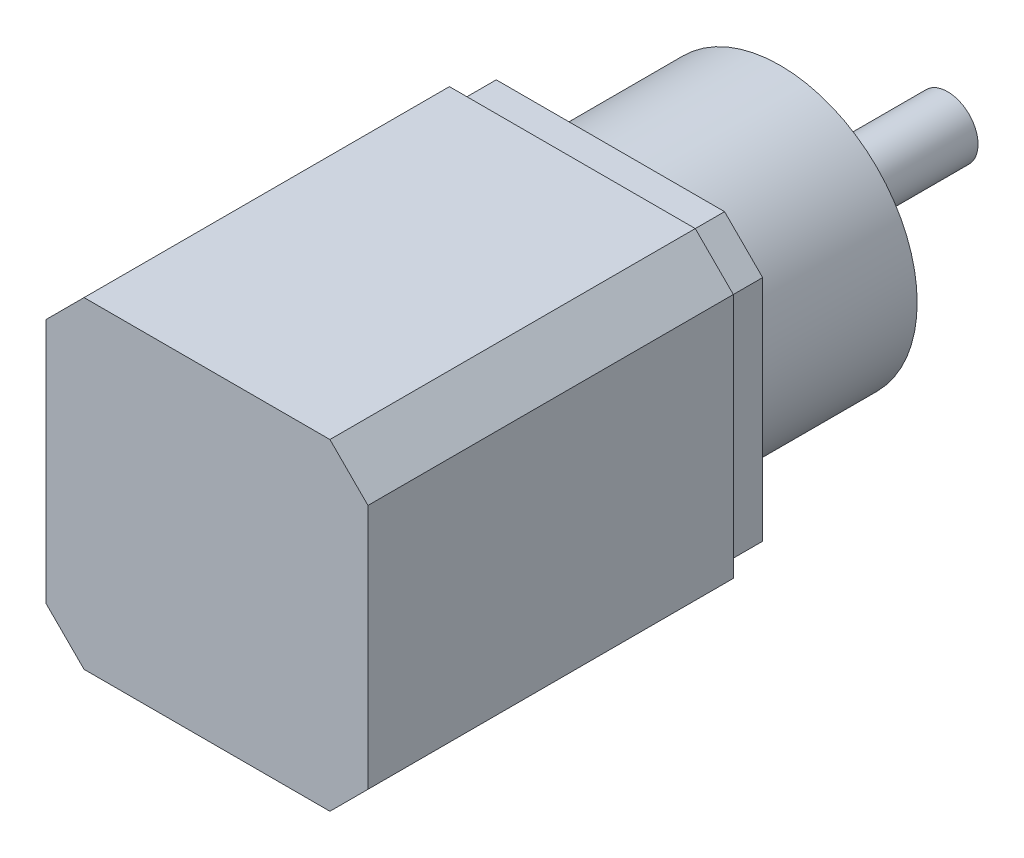
ISO-10303-21;
HEADER;
FILE_DESCRIPTION(('STEP AP214'),'2;1');
FILE_NAME('part.step','',(''),(''),'','','');
FILE_SCHEMA(('AUTOMOTIVE_DESIGN { 1 0 10303 214 1 1 1 1 }'));
ENDSEC;
DATA;
#1=APPLICATION_CONTEXT('core data for automotive mechanical design processes');
#2=APPLICATION_PROTOCOL_DEFINITION('international standard','automotive_design',2000,#1);
#3=PRODUCT_CONTEXT('',#1,'mechanical');
#4=PRODUCT('Part','Part','',(#3));
#5=PRODUCT_RELATED_PRODUCT_CATEGORY('part','',(#4));
#6=PRODUCT_DEFINITION_FORMATION('','',#4);
#7=PRODUCT_DEFINITION_CONTEXT('part definition',#1,'design');
#8=PRODUCT_DEFINITION('design','',#6,#7);
#9=PRODUCT_DEFINITION_SHAPE('','',#8);
#10=(LENGTH_UNIT() NAMED_UNIT(*) SI_UNIT(.MILLI.,.METRE.));
#11=(NAMED_UNIT(*) PLANE_ANGLE_UNIT() SI_UNIT($,.RADIAN.));
#12=(NAMED_UNIT(*) SI_UNIT($,.STERADIAN.) SOLID_ANGLE_UNIT());
#13=UNCERTAINTY_MEASURE_WITH_UNIT(LENGTH_MEASURE(1.E-05),#10,'distance_accuracy_value','');
#14=(GEOMETRIC_REPRESENTATION_CONTEXT(3) GLOBAL_UNCERTAINTY_ASSIGNED_CONTEXT((#13)) GLOBAL_UNIT_ASSIGNED_CONTEXT((#10,
#11,#12)) REPRESENTATION_CONTEXT('',''));
#15=CARTESIAN_POINT('',(0.,0.,0.));
#16=DIRECTION('',(0.,0.,1.));
#17=DIRECTION('',(1.,0.,0.));
#18=AXIS2_PLACEMENT_3D('',#15,#16,#17);
#19=CARTESIAN_POINT('',(0.,0.,0.));
#20=DIRECTION('',(0.,0.,1.));
#21=DIRECTION('',(1.,0.,0.));
#22=AXIS2_PLACEMENT_3D('',#19,#20,#21);
#23=PLANE('',#22);
#24=DIRECTION('',(-0.707106781186549,-0.707106781186546,0.));
#25=VECTOR('',#24,1.);
#26=CARTESIAN_POINT('',(-21.15,16.15,0.));
#27=LINE('',#26,#25);
#28=CARTESIAN_POINT('',(-21.15,16.15,0.));
#29=VERTEX_POINT('',#28);
#30=CARTESIAN_POINT('',(-16.15,21.15,0.));
#31=VERTEX_POINT('',#30);
#32=EDGE_CURVE('E244',#29,#31,#27,.F.);
#33=ORIENTED_EDGE('',*,*,#32,.T.);
#34=DIRECTION('',(-1.,0.,0.));
#35=VECTOR('',#34,1.);
#36=CARTESIAN_POINT('',(-21.15,21.15,0.));
#37=LINE('',#36,#35);
#38=CARTESIAN_POINT('',(16.15,21.15,0.));
#39=VERTEX_POINT('',#38);
#40=EDGE_CURVE('E228',#39,#31,#37,.T.);
#41=ORIENTED_EDGE('',*,*,#40,.F.);
#42=DIRECTION('',(-0.707106781186546,0.707106781186549,0.));
#43=VECTOR('',#42,1.);
#44=CARTESIAN_POINT('',(16.15,21.15,0.));
#45=LINE('',#44,#43);
#46=CARTESIAN_POINT('',(21.15,16.15,0.));
#47=VERTEX_POINT('',#46);
#48=EDGE_CURVE('E241',#39,#47,#45,.F.);
#49=ORIENTED_EDGE('',*,*,#48,.T.);
#50=DIRECTION('',(0.,1.,0.));
#51=VECTOR('',#50,1.);
#52=CARTESIAN_POINT('',(21.15,21.15,0.));
#53=LINE('',#52,#51);
#54=CARTESIAN_POINT('',(21.15,-16.15,0.));
#55=VERTEX_POINT('',#54);
#56=EDGE_CURVE('E201',#55,#47,#53,.T.);
#57=ORIENTED_EDGE('',*,*,#56,.F.);
#58=DIRECTION('',(0.707106781186549,0.707106781186547,0.));
#59=VECTOR('',#58,1.);
#60=CARTESIAN_POINT('',(21.15,-16.15,0.));
#61=LINE('',#60,#59);
#62=CARTESIAN_POINT('',(16.15,-21.15,0.));
#63=VERTEX_POINT('',#62);
#64=EDGE_CURVE('E247',#55,#63,#61,.F.);
#65=ORIENTED_EDGE('',*,*,#64,.T.);
#66=DIRECTION('',(1.,0.,0.));
#67=VECTOR('',#66,1.);
#68=CARTESIAN_POINT('',(-21.15,-21.15,0.));
#69=LINE('',#68,#67);
#70=CARTESIAN_POINT('',(-16.15,-21.15,0.));
#71=VERTEX_POINT('',#70);
#72=EDGE_CURVE('E216',#71,#63,#69,.T.);
#73=ORIENTED_EDGE('',*,*,#72,.F.);
#74=DIRECTION('',(0.707106781186546,-0.707106781186549,0.));
#75=VECTOR('',#74,1.);
#76=CARTESIAN_POINT('',(-16.15,-21.15,0.));
#77=LINE('',#76,#75);
#78=CARTESIAN_POINT('',(-21.15,-16.15,0.));
#79=VERTEX_POINT('',#78);
#80=EDGE_CURVE('E250',#71,#79,#77,.F.);
#81=ORIENTED_EDGE('',*,*,#80,.T.);
#82=DIRECTION('',(0.,-1.,0.));
#83=VECTOR('',#82,1.);
#84=CARTESIAN_POINT('',(-21.15,21.15,0.));
#85=LINE('',#84,#83);
#86=EDGE_CURVE('E231',#29,#79,#85,.T.);
#87=ORIENTED_EDGE('',*,*,#86,.F.);
#88=EDGE_LOOP('',(#33,#41,#49,#57,#65,#73,#81,#87));
#89=FACE_BOUND('',#88,.T.);
#90=DIRECTION('',(0.,1.,0.));
#91=VECTOR('',#90,1.);
#92=CARTESIAN_POINT('',(-20.,-20.,0.));
#93=LINE('',#92,#91);
#94=CARTESIAN_POINT('',(-20.,-15.,0.));
#95=VERTEX_POINT('',#94);
#96=CARTESIAN_POINT('',(-20.,15.,0.));
#97=VERTEX_POINT('',#96);
#98=EDGE_CURVE('E202',#95,#97,#93,.T.);
#99=ORIENTED_EDGE('',*,*,#98,.F.);
#100=DIRECTION('',(-0.707106781186549,0.707106781186547,0.));
#101=VECTOR('',#100,1.);
#102=CARTESIAN_POINT('',(-17.5,-17.5,0.));
#103=LINE('',#102,#101);
#104=CARTESIAN_POINT('',(-15.,-20.,0.));
#105=VERTEX_POINT('',#104);
#106=EDGE_CURVE('E150',#95,#105,#103,.F.);
#107=ORIENTED_EDGE('',*,*,#106,.T.);
#108=DIRECTION('',(-1.,0.,0.));
#109=VECTOR('',#108,1.);
#110=CARTESIAN_POINT('',(20.,-20.,0.));
#111=LINE('',#110,#109);
#112=CARTESIAN_POINT('',(15.,-20.,0.));
#113=VERTEX_POINT('',#112);
#114=EDGE_CURVE('E205',#113,#105,#111,.T.);
#115=ORIENTED_EDGE('',*,*,#114,.F.);
#116=DIRECTION('',(-0.707106781186547,-0.707106781186549,0.));
#117=VECTOR('',#116,1.);
#118=CARTESIAN_POINT('',(17.5,-17.5,0.));
#119=LINE('',#118,#117);
#120=CARTESIAN_POINT('',(20.,-15.,0.));
#121=VERTEX_POINT('',#120);
#122=EDGE_CURVE('E118',#113,#121,#119,.F.);
#123=ORIENTED_EDGE('',*,*,#122,.T.);
#124=DIRECTION('',(0.,-1.,0.));
#125=VECTOR('',#124,1.);
#126=CARTESIAN_POINT('',(20.,-20.,0.));
#127=LINE('',#126,#125);
#128=CARTESIAN_POINT('',(20.,15.,0.));
#129=VERTEX_POINT('',#128);
#130=EDGE_CURVE('E207',#129,#121,#127,.T.);
#131=ORIENTED_EDGE('',*,*,#130,.F.);
#132=DIRECTION('',(0.707106781186549,-0.707106781186547,0.));
#133=VECTOR('',#132,1.);
#134=CARTESIAN_POINT('',(17.5,17.5,0.));
#135=LINE('',#134,#133);
#136=CARTESIAN_POINT('',(15.,20.,0.));
#137=VERTEX_POINT('',#136);
#138=EDGE_CURVE('E55',#129,#137,#135,.F.);
#139=ORIENTED_EDGE('',*,*,#138,.T.);
#140=DIRECTION('',(1.,0.,0.));
#141=VECTOR('',#140,1.);
#142=CARTESIAN_POINT('',(20.,20.,0.));
#143=LINE('',#142,#141);
#144=CARTESIAN_POINT('',(-15.,20.,0.));
#145=VERTEX_POINT('',#144);
#146=EDGE_CURVE('E116',#145,#137,#143,.T.);
#147=ORIENTED_EDGE('',*,*,#146,.F.);
#148=DIRECTION('',(0.707106781186547,0.707106781186549,0.));
#149=VECTOR('',#148,1.);
#150=CARTESIAN_POINT('',(-17.5,17.5,0.));
#151=LINE('',#150,#149);
#152=EDGE_CURVE('E154',#145,#97,#151,.F.);
#153=ORIENTED_EDGE('',*,*,#152,.T.);
#154=EDGE_LOOP('',(#99,#107,#115,#123,#131,#139,#147,#153));
#155=FACE_BOUND('',#154,.T.);
#156=ADVANCED_FACE('F32',(#89,#155),#23,.F.);
#157=CARTESIAN_POINT('',(21.15,21.15,48.));
#158=DIRECTION('',(-1.,0.,0.));
#159=DIRECTION('',(0.,-1.,0.));
#160=AXIS2_PLACEMENT_3D('',#157,#158,#159);
#161=PLANE('',#160);
#162=DIRECTION('',(0.,1.,0.));
#163=VECTOR('',#162,1.);
#164=CARTESIAN_POINT('',(21.15,21.15,48.));
#165=LINE('',#164,#163);
#166=CARTESIAN_POINT('',(21.15,-16.15,48.));
#167=VERTEX_POINT('',#166);
#168=CARTESIAN_POINT('',(21.15,16.15,48.));
#169=VERTEX_POINT('',#168);
#170=EDGE_CURVE('E212',#167,#169,#165,.T.);
#171=ORIENTED_EDGE('',*,*,#170,.F.);
#172=DIRECTION('',(0.,0.,-1.));
#173=VECTOR('',#172,1.);
#174=CARTESIAN_POINT('',(21.15,-16.15,48.));
#175=LINE('',#174,#173);
#176=EDGE_CURVE('E274',#167,#55,#175,.T.);
#177=ORIENTED_EDGE('',*,*,#176,.T.);
#178=ORIENTED_EDGE('',*,*,#56,.T.);
#179=DIRECTION('',(0.,0.,1.));
#180=VECTOR('',#179,1.);
#181=CARTESIAN_POINT('',(21.15,16.15,48.));
#182=LINE('',#181,#180);
#183=EDGE_CURVE('E271',#47,#169,#182,.T.);
#184=ORIENTED_EDGE('',*,*,#183,.T.);
#185=EDGE_LOOP('',(#171,#177,#178,#184));
#186=FACE_BOUND('',#185,.T.);
#187=ADVANCED_FACE('F315',(#186),#161,.F.);
#188=CARTESIAN_POINT('',(-21.15,21.15,48.));
#189=DIRECTION('',(0.,-1.,0.));
#190=DIRECTION('',(0.,0.,-1.));
#191=AXIS2_PLACEMENT_3D('',#188,#189,#190);
#192=PLANE('',#191);
#193=ORIENTED_EDGE('',*,*,#40,.T.);
#194=DIRECTION('',(0.,0.,1.));
#195=VECTOR('',#194,1.);
#196=CARTESIAN_POINT('',(-16.15,21.15,48.));
#197=LINE('',#196,#195);
#198=CARTESIAN_POINT('',(-16.15,21.15,48.));
#199=VERTEX_POINT('',#198);
#200=EDGE_CURVE('E208',#31,#199,#197,.T.);
#201=ORIENTED_EDGE('',*,*,#200,.T.);
#202=DIRECTION('',(-1.,0.,0.));
#203=VECTOR('',#202,1.);
#204=CARTESIAN_POINT('',(-21.15,21.15,48.));
#205=LINE('',#204,#203);
#206=CARTESIAN_POINT('',(16.15,21.15,48.));
#207=VERTEX_POINT('',#206);
#208=EDGE_CURVE('E215',#207,#199,#205,.T.);
#209=ORIENTED_EDGE('',*,*,#208,.F.);
#210=DIRECTION('',(0.,0.,-1.));
#211=VECTOR('',#210,1.);
#212=CARTESIAN_POINT('',(16.15,21.15,48.));
#213=LINE('',#212,#211);
#214=EDGE_CURVE('E277',#207,#39,#213,.T.);
#215=ORIENTED_EDGE('',*,*,#214,.T.);
#216=EDGE_LOOP('',(#193,#201,#209,#215));
#217=FACE_BOUND('',#216,.T.);
#218=ADVANCED_FACE('F321',(#217),#192,.F.);
#219=CARTESIAN_POINT('',(-21.15,21.15,48.));
#220=DIRECTION('',(1.,0.,0.));
#221=DIRECTION('',(0.,1.,0.));
#222=AXIS2_PLACEMENT_3D('',#219,#220,#221);
#223=PLANE('',#222);
#224=ORIENTED_EDGE('',*,*,#86,.T.);
#225=DIRECTION('',(0.,0.,1.));
#226=VECTOR('',#225,1.);
#227=CARTESIAN_POINT('',(-21.15,-16.15,48.));
#228=LINE('',#227,#226);
#229=CARTESIAN_POINT('',(-21.15,-16.15,48.));
#230=VERTEX_POINT('',#229);
#231=EDGE_CURVE('E256',#79,#230,#228,.T.);
#232=ORIENTED_EDGE('',*,*,#231,.T.);
#233=DIRECTION('',(0.,-1.,0.));
#234=VECTOR('',#233,1.);
#235=CARTESIAN_POINT('',(-21.15,21.15,48.));
#236=LINE('',#235,#234);
#237=CARTESIAN_POINT('',(-21.15,16.15,48.));
#238=VERTEX_POINT('',#237);
#239=EDGE_CURVE('E219',#238,#230,#236,.T.);
#240=ORIENTED_EDGE('',*,*,#239,.F.);
#241=DIRECTION('',(0.,0.,-1.));
#242=VECTOR('',#241,1.);
#243=CARTESIAN_POINT('',(-21.15,16.15,48.));
#244=LINE('',#243,#242);
#245=EDGE_CURVE('E253',#238,#29,#244,.T.);
#246=ORIENTED_EDGE('',*,*,#245,.T.);
#247=EDGE_LOOP('',(#224,#232,#240,#246));
#248=FACE_BOUND('',#247,.T.);
#249=ADVANCED_FACE('F331',(#248),#223,.F.);
#250=CARTESIAN_POINT('',(-21.15,-21.15,48.));
#251=DIRECTION('',(0.,1.,0.));
#252=DIRECTION('',(0.,0.,1.));
#253=AXIS2_PLACEMENT_3D('',#250,#251,#252);
#254=PLANE('',#253);
#255=DIRECTION('',(1.,0.,0.));
#256=VECTOR('',#255,1.);
#257=CARTESIAN_POINT('',(-21.15,-21.15,48.));
#258=LINE('',#257,#256);
#259=CARTESIAN_POINT('',(-16.15,-21.15,48.));
#260=VERTEX_POINT('',#259);
#261=CARTESIAN_POINT('',(16.15,-21.15,48.));
#262=VERTEX_POINT('',#261);
#263=EDGE_CURVE('E222',#260,#262,#258,.T.);
#264=ORIENTED_EDGE('',*,*,#263,.F.);
#265=DIRECTION('',(0.,0.,-1.));
#266=VECTOR('',#265,1.);
#267=CARTESIAN_POINT('',(-16.15,-21.15,48.));
#268=LINE('',#267,#266);
#269=EDGE_CURVE('E238',#260,#71,#268,.T.);
#270=ORIENTED_EDGE('',*,*,#269,.T.);
#271=ORIENTED_EDGE('',*,*,#72,.T.);
#272=DIRECTION('',(0.,0.,1.));
#273=VECTOR('',#272,1.);
#274=CARTESIAN_POINT('',(16.15,-21.15,48.));
#275=LINE('',#274,#273);
#276=EDGE_CURVE('E225',#63,#262,#275,.T.);
#277=ORIENTED_EDGE('',*,*,#276,.T.);
#278=EDGE_LOOP('',(#264,#270,#271,#277));
#279=FACE_BOUND('',#278,.T.);
#280=ADVANCED_FACE('F328',(#279),#254,.F.);
#281=CARTESIAN_POINT('',(0.,0.,48.));
#282=DIRECTION('',(0.,0.,1.));
#283=DIRECTION('',(1.,0.,0.));
#284=AXIS2_PLACEMENT_3D('',#281,#282,#283);
#285=PLANE('',#284);
#286=ORIENTED_EDGE('',*,*,#239,.T.);
#287=DIRECTION('',(-0.707106781186546,0.707106781186549,0.));
#288=VECTOR('',#287,1.);
#289=CARTESIAN_POINT('',(-18.65,-18.65,48.));
#290=LINE('',#289,#288);
#291=EDGE_CURVE('E268',#230,#260,#290,.F.);
#292=ORIENTED_EDGE('',*,*,#291,.T.);
#293=ORIENTED_EDGE('',*,*,#263,.T.);
#294=DIRECTION('',(-0.707106781186549,-0.707106781186547,0.));
#295=VECTOR('',#294,1.);
#296=CARTESIAN_POINT('',(18.65,-18.65,48.));
#297=LINE('',#296,#295);
#298=EDGE_CURVE('E265',#262,#167,#297,.F.);
#299=ORIENTED_EDGE('',*,*,#298,.T.);
#300=ORIENTED_EDGE('',*,*,#170,.T.);
#301=DIRECTION('',(0.707106781186546,-0.707106781186549,0.));
#302=VECTOR('',#301,1.);
#303=CARTESIAN_POINT('',(18.65,18.65,48.));
#304=LINE('',#303,#302);
#305=EDGE_CURVE('E259',#169,#207,#304,.F.);
#306=ORIENTED_EDGE('',*,*,#305,.T.);
#307=ORIENTED_EDGE('',*,*,#208,.T.);
#308=DIRECTION('',(0.707106781186549,0.707106781186546,0.));
#309=VECTOR('',#308,1.);
#310=CARTESIAN_POINT('',(-18.65,18.65,48.));
#311=LINE('',#310,#309);
#312=EDGE_CURVE('E262',#199,#238,#311,.F.);
#313=ORIENTED_EDGE('',*,*,#312,.T.);
#314=EDGE_LOOP('',(#286,#292,#293,#299,#300,#306,#307,#313));
#315=FACE_BOUND('',#314,.T.);
#316=ADVANCED_FACE('F326',(#315),#285,.T.);
#317=CARTESIAN_POINT('',(-16.15,-21.15,48.));
#318=DIRECTION('',(0.707106781186549,0.707106781186546,0.));
#319=DIRECTION('',(0.,0.,-1.));
#320=AXIS2_PLACEMENT_3D('',#317,#318,#319);
#321=PLANE('',#320);
#322=ORIENTED_EDGE('',*,*,#291,.F.);
#323=ORIENTED_EDGE('',*,*,#231,.F.);
#324=ORIENTED_EDGE('',*,*,#80,.F.);
#325=ORIENTED_EDGE('',*,*,#269,.F.);
#326=EDGE_LOOP('',(#322,#323,#324,#325));
#327=FACE_BOUND('',#326,.T.);
#328=ADVANCED_FACE('F339',(#327),#321,.F.);
#329=CARTESIAN_POINT('',(21.15,-16.15,48.));
#330=DIRECTION('',(-0.707106781186546,0.707106781186548,0.));
#331=DIRECTION('',(0.,0.,-1.));
#332=AXIS2_PLACEMENT_3D('',#329,#330,#331);
#333=PLANE('',#332);
#334=ORIENTED_EDGE('',*,*,#298,.F.);
#335=ORIENTED_EDGE('',*,*,#276,.F.);
#336=ORIENTED_EDGE('',*,*,#64,.F.);
#337=ORIENTED_EDGE('',*,*,#176,.F.);
#338=EDGE_LOOP('',(#334,#335,#336,#337));
#339=FACE_BOUND('',#338,.T.);
#340=ADVANCED_FACE('F342',(#339),#333,.F.);
#341=CARTESIAN_POINT('',(-21.15,16.15,48.));
#342=DIRECTION('',(0.707106781186546,-0.707106781186549,0.));
#343=DIRECTION('',(0.,0.,-1.));
#344=AXIS2_PLACEMENT_3D('',#341,#342,#343);
#345=PLANE('',#344);
#346=ORIENTED_EDGE('',*,*,#312,.F.);
#347=ORIENTED_EDGE('',*,*,#200,.F.);
#348=ORIENTED_EDGE('',*,*,#32,.F.);
#349=ORIENTED_EDGE('',*,*,#245,.F.);
#350=EDGE_LOOP('',(#346,#347,#348,#349));
#351=FACE_BOUND('',#350,.T.);
#352=ADVANCED_FACE('F346',(#351),#345,.F.);
#353=CARTESIAN_POINT('',(16.15,21.15,48.));
#354=DIRECTION('',(-0.707106781186549,-0.707106781186546,0.));
#355=DIRECTION('',(0.,0.,-1.));
#356=AXIS2_PLACEMENT_3D('',#353,#354,#355);
#357=PLANE('',#356);
#358=ORIENTED_EDGE('',*,*,#305,.F.);
#359=ORIENTED_EDGE('',*,*,#183,.F.);
#360=ORIENTED_EDGE('',*,*,#48,.F.);
#361=ORIENTED_EDGE('',*,*,#214,.F.);
#362=EDGE_LOOP('',(#358,#359,#360,#361));
#363=FACE_BOUND('',#362,.T.);
#364=ADVANCED_FACE('F350',(#363),#357,.F.);
#365=CARTESIAN_POINT('',(-20.,-20.,-5.));
#366=DIRECTION('',(1.,0.,0.));
#367=DIRECTION('',(0.,0.,-1.));
#368=AXIS2_PLACEMENT_3D('',#365,#366,#367);
#369=PLANE('',#368);
#370=DIRECTION('',(0.,1.,0.));
#371=VECTOR('',#370,1.);
#372=CARTESIAN_POINT('',(-20.,-20.,-5.));
#373=LINE('',#372,#371);
#374=CARTESIAN_POINT('',(-20.,-15.,-5.));
#375=VERTEX_POINT('',#374);
#376=CARTESIAN_POINT('',(-20.,15.,-5.));
#377=VERTEX_POINT('',#376);
#378=EDGE_CURVE('E130',#375,#377,#373,.T.);
#379=ORIENTED_EDGE('',*,*,#378,.F.);
#380=DIRECTION('',(0.,0.,1.));
#381=VECTOR('',#380,1.);
#382=CARTESIAN_POINT('',(-20.,-15.,-5.));
#383=LINE('',#382,#381);
#384=EDGE_CURVE('E145',#375,#95,#383,.T.);
#385=ORIENTED_EDGE('',*,*,#384,.T.);
#386=ORIENTED_EDGE('',*,*,#98,.T.);
#387=DIRECTION('',(0.,0.,-1.));
#388=VECTOR('',#387,1.);
#389=CARTESIAN_POINT('',(-20.,15.,-5.));
#390=LINE('',#389,#388);
#391=EDGE_CURVE('E143',#97,#377,#390,.T.);
#392=ORIENTED_EDGE('',*,*,#391,.T.);
#393=EDGE_LOOP('',(#379,#385,#386,#392));
#394=FACE_BOUND('',#393,.T.);
#395=ADVANCED_FACE('F302',(#394),#369,.F.);
#396=CARTESIAN_POINT('',(20.,20.,-5.));
#397=DIRECTION('',(0.,-1.,0.));
#398=DIRECTION('',(0.,0.,-1.));
#399=AXIS2_PLACEMENT_3D('',#396,#397,#398);
#400=PLANE('',#399);
#401=ORIENTED_EDGE('',*,*,#146,.T.);
#402=DIRECTION('',(0.,0.,-1.));
#403=VECTOR('',#402,1.);
#404=CARTESIAN_POINT('',(15.,20.,-5.));
#405=LINE('',#404,#403);
#406=CARTESIAN_POINT('',(15.,20.,-5.));
#407=VERTEX_POINT('',#406);
#408=EDGE_CURVE('E110',#137,#407,#405,.T.);
#409=ORIENTED_EDGE('',*,*,#408,.T.);
#410=DIRECTION('',(1.,0.,0.));
#411=VECTOR('',#410,1.);
#412=CARTESIAN_POINT('',(20.,20.,-5.));
#413=LINE('',#412,#411);
#414=CARTESIAN_POINT('',(-15.,20.,-5.));
#415=VERTEX_POINT('',#414);
#416=EDGE_CURVE('E114',#415,#407,#413,.T.);
#417=ORIENTED_EDGE('',*,*,#416,.F.);
#418=DIRECTION('',(0.,0.,1.));
#419=VECTOR('',#418,1.);
#420=CARTESIAN_POINT('',(-15.,20.,-5.));
#421=LINE('',#420,#419);
#422=EDGE_CURVE('E119',#415,#145,#421,.T.);
#423=ORIENTED_EDGE('',*,*,#422,.T.);
#424=EDGE_LOOP('',(#401,#409,#417,#423));
#425=FACE_BOUND('',#424,.T.);
#426=ADVANCED_FACE('F112',(#425),#400,.F.);
#427=CARTESIAN_POINT('',(20.,-20.,-5.));
#428=DIRECTION('',(-1.,0.,0.));
#429=DIRECTION('',(0.,0.,1.));
#430=AXIS2_PLACEMENT_3D('',#427,#428,#429);
#431=PLANE('',#430);
#432=ORIENTED_EDGE('',*,*,#130,.T.);
#433=DIRECTION('',(0.,0.,-1.));
#434=VECTOR('',#433,1.);
#435=CARTESIAN_POINT('',(20.,-15.,-5.));
#436=LINE('',#435,#434);
#437=CARTESIAN_POINT('',(20.,-15.,-5.));
#438=VERTEX_POINT('',#437);
#439=EDGE_CURVE('E138',#121,#438,#436,.T.);
#440=ORIENTED_EDGE('',*,*,#439,.T.);
#441=DIRECTION('',(0.,-1.,0.));
#442=VECTOR('',#441,1.);
#443=CARTESIAN_POINT('',(20.,-20.,-5.));
#444=LINE('',#443,#442);
#445=CARTESIAN_POINT('',(20.,15.,-5.));
#446=VERTEX_POINT('',#445);
#447=EDGE_CURVE('E129',#446,#438,#444,.T.);
#448=ORIENTED_EDGE('',*,*,#447,.F.);
#449=DIRECTION('',(0.,0.,1.));
#450=VECTOR('',#449,1.);
#451=CARTESIAN_POINT('',(20.,15.,-5.));
#452=LINE('',#451,#450);
#453=EDGE_CURVE('E133',#446,#129,#452,.T.);
#454=ORIENTED_EDGE('',*,*,#453,.T.);
#455=EDGE_LOOP('',(#432,#440,#448,#454));
#456=FACE_BOUND('',#455,.T.);
#457=ADVANCED_FACE('F288',(#456),#431,.F.);
#458=CARTESIAN_POINT('',(20.,-20.,-5.));
#459=DIRECTION('',(0.,1.,0.));
#460=DIRECTION('',(0.,0.,1.));
#461=AXIS2_PLACEMENT_3D('',#458,#459,#460);
#462=PLANE('',#461);
#463=DIRECTION('',(-1.,0.,0.));
#464=VECTOR('',#463,1.);
#465=CARTESIAN_POINT('',(20.,-20.,-5.));
#466=LINE('',#465,#464);
#467=CARTESIAN_POINT('',(15.,-20.,-5.));
#468=VERTEX_POINT('',#467);
#469=CARTESIAN_POINT('',(-15.,-20.,-5.));
#470=VERTEX_POINT('',#469);
#471=EDGE_CURVE('E199',#468,#470,#466,.T.);
#472=ORIENTED_EDGE('',*,*,#471,.F.);
#473=DIRECTION('',(0.,0.,1.));
#474=VECTOR('',#473,1.);
#475=CARTESIAN_POINT('',(15.,-20.,-5.));
#476=LINE('',#475,#474);
#477=EDGE_CURVE('E283',#468,#113,#476,.T.);
#478=ORIENTED_EDGE('',*,*,#477,.T.);
#479=ORIENTED_EDGE('',*,*,#114,.T.);
#480=DIRECTION('',(0.,0.,-1.));
#481=VECTOR('',#480,1.);
#482=CARTESIAN_POINT('',(-15.,-20.,-5.));
#483=LINE('',#482,#481);
#484=EDGE_CURVE('E88',#105,#470,#483,.T.);
#485=ORIENTED_EDGE('',*,*,#484,.T.);
#486=EDGE_LOOP('',(#472,#478,#479,#485));
#487=FACE_BOUND('',#486,.T.);
#488=ADVANCED_FACE('F294',(#487),#462,.F.);
#489=CARTESIAN_POINT('',(0.,0.,-5.));
#490=DIRECTION('',(0.,0.,1.));
#491=DIRECTION('',(1.,0.,0.));
#492=AXIS2_PLACEMENT_3D('',#489,#490,#491);
#493=PLANE('',#492);
#494=CARTESIAN_POINT('',(0.,0.,-5.));
#495=DIRECTION('',(0.,0.,1.));
#496=DIRECTION('',(1.,0.,0.));
#497=AXIS2_PLACEMENT_3D('',#494,#495,#496);
#498=CIRCLE('',#497,18.);
#499=CARTESIAN_POINT('',(18.,0.,-5.));
#500=VERTEX_POINT('',#499);
#501=EDGE_CURVE('E157',#500,#500,#498,.F.);
#502=ORIENTED_EDGE('',*,*,#501,.F.);
#503=EDGE_LOOP('',(#502));
#504=FACE_BOUND('',#503,.T.);
#505=ORIENTED_EDGE('',*,*,#447,.T.);
#506=DIRECTION('',(0.707106781186547,0.707106781186549,0.));
#507=VECTOR('',#506,1.);
#508=CARTESIAN_POINT('',(15.,-20.,-5.));
#509=LINE('',#508,#507);
#510=EDGE_CURVE('E136',#438,#468,#509,.F.);
#511=ORIENTED_EDGE('',*,*,#510,.T.);
#512=ORIENTED_EDGE('',*,*,#471,.T.);
#513=DIRECTION('',(0.707106781186549,-0.707106781186547,0.));
#514=VECTOR('',#513,1.);
#515=CARTESIAN_POINT('',(-20.,-15.,-5.));
#516=LINE('',#515,#514);
#517=EDGE_CURVE('E134',#470,#375,#516,.F.);
#518=ORIENTED_EDGE('',*,*,#517,.T.);
#519=ORIENTED_EDGE('',*,*,#378,.T.);
#520=DIRECTION('',(-0.707106781186547,-0.707106781186549,0.));
#521=VECTOR('',#520,1.);
#522=CARTESIAN_POINT('',(-15.,20.,-5.));
#523=LINE('',#522,#521);
#524=EDGE_CURVE('E128',#377,#415,#523,.F.);
#525=ORIENTED_EDGE('',*,*,#524,.T.);
#526=ORIENTED_EDGE('',*,*,#416,.T.);
#527=DIRECTION('',(-0.707106781186549,0.707106781186547,0.));
#528=VECTOR('',#527,1.);
#529=CARTESIAN_POINT('',(20.,15.,-5.));
#530=LINE('',#529,#528);
#531=EDGE_CURVE('E124',#407,#446,#530,.F.);
#532=ORIENTED_EDGE('',*,*,#531,.T.);
#533=EDGE_LOOP('',(#505,#511,#512,#518,#519,#525,#526,#532));
#534=FACE_BOUND('',#533,.T.);
#535=ADVANCED_FACE('F123',(#504,#534),#493,.F.);
#536=CARTESIAN_POINT('',(15.,-20.,-5.));
#537=DIRECTION('',(-0.707106781186548,0.707106781186546,0.));
#538=DIRECTION('',(0.,0.,1.));
#539=AXIS2_PLACEMENT_3D('',#536,#537,#538);
#540=PLANE('',#539);
#541=ORIENTED_EDGE('',*,*,#510,.F.);
#542=ORIENTED_EDGE('',*,*,#439,.F.);
#543=ORIENTED_EDGE('',*,*,#122,.F.);
#544=ORIENTED_EDGE('',*,*,#477,.F.);
#545=EDGE_LOOP('',(#541,#542,#543,#544));
#546=FACE_BOUND('',#545,.T.);
#547=ADVANCED_FACE('F292',(#546),#540,.F.);
#548=CARTESIAN_POINT('',(-20.,-15.,-5.));
#549=DIRECTION('',(0.707106781186546,0.707106781186548,0.));
#550=DIRECTION('',(0.,0.,1.));
#551=AXIS2_PLACEMENT_3D('',#548,#549,#550);
#552=PLANE('',#551);
#553=ORIENTED_EDGE('',*,*,#517,.F.);
#554=ORIENTED_EDGE('',*,*,#484,.F.);
#555=ORIENTED_EDGE('',*,*,#106,.F.);
#556=ORIENTED_EDGE('',*,*,#384,.F.);
#557=EDGE_LOOP('',(#553,#554,#555,#556));
#558=FACE_BOUND('',#557,.T.);
#559=ADVANCED_FACE('F299',(#558),#552,.F.);
#560=CARTESIAN_POINT('',(20.,15.,-5.));
#561=DIRECTION('',(-0.707106781186546,-0.707106781186548,0.));
#562=DIRECTION('',(0.,0.,1.));
#563=AXIS2_PLACEMENT_3D('',#560,#561,#562);
#564=PLANE('',#563);
#565=ORIENTED_EDGE('',*,*,#531,.F.);
#566=ORIENTED_EDGE('',*,*,#408,.F.);
#567=ORIENTED_EDGE('',*,*,#138,.F.);
#568=ORIENTED_EDGE('',*,*,#453,.F.);
#569=EDGE_LOOP('',(#565,#566,#567,#568));
#570=FACE_BOUND('',#569,.T.);
#571=ADVANCED_FACE('F132',(#570),#564,.F.);
#572=CARTESIAN_POINT('',(-15.,20.,-5.));
#573=DIRECTION('',(0.707106781186548,-0.707106781186546,0.));
#574=DIRECTION('',(0.,0.,1.));
#575=AXIS2_PLACEMENT_3D('',#572,#573,#574);
#576=PLANE('',#575);
#577=ORIENTED_EDGE('',*,*,#524,.F.);
#578=ORIENTED_EDGE('',*,*,#391,.F.);
#579=ORIENTED_EDGE('',*,*,#152,.F.);
#580=ORIENTED_EDGE('',*,*,#422,.F.);
#581=EDGE_LOOP('',(#577,#578,#579,#580));
#582=FACE_BOUND('',#581,.T.);
#583=ADVANCED_FACE('F34',(#582),#576,.F.);
#584=CARTESIAN_POINT('',(0.,0.,-27.3));
#585=DIRECTION('',(0.,0.,1.));
#586=DIRECTION('',(1.,0.,0.));
#587=AXIS2_PLACEMENT_3D('',#584,#585,#586);
#588=CYLINDRICAL_SURFACE('',#587,18.);
#589=CARTESIAN_POINT('',(0.,0.,-27.3));
#590=DIRECTION('',(0.,0.,-1.));
#591=DIRECTION('',(-1.,0.,0.));
#592=AXIS2_PLACEMENT_3D('',#589,#590,#591);
#593=CIRCLE('',#592,18.);
#594=CARTESIAN_POINT('',(-18.,0.,-27.3));
#595=VERTEX_POINT('',#594);
#596=EDGE_CURVE('E193',#595,#595,#593,.T.);
#597=ORIENTED_EDGE('',*,*,#596,.F.);
#598=EDGE_LOOP('',(#597));
#599=FACE_BOUND('',#598,.T.);
#600=ORIENTED_EDGE('',*,*,#501,.T.);
#601=EDGE_LOOP('',(#600));
#602=FACE_BOUND('',#601,.T.);
#603=ADVANCED_FACE('F306',(#599,#602),#588,.T.);
#604=CARTESIAN_POINT('',(0.,0.,-27.3));
#605=DIRECTION('',(0.,0.,-1.));
#606=DIRECTION('',(-1.,0.,0.));
#607=AXIS2_PLACEMENT_3D('',#604,#605,#606);
#608=PLANE('',#607);
#609=CARTESIAN_POINT('',(9.89949493661167,9.89949493661112,-27.3));
#610=DIRECTION('',(0.,0.,-1.));
#611=DIRECTION('',(-1.,0.,0.));
#612=AXIS2_PLACEMENT_3D('',#609,#610,#611);
#613=CIRCLE('',#612,1.2500000000006);
#614=CARTESIAN_POINT('',(8.64949493661107,9.89949493661112,-27.3));
#615=VERTEX_POINT('',#614);
#616=EDGE_CURVE('E707',#615,#615,#613,.T.);
#617=ORIENTED_EDGE('',*,*,#616,.F.);
#618=EDGE_LOOP('',(#617));
#619=FACE_BOUND('',#618,.T.);
#620=CARTESIAN_POINT('',(9.89949493661112,-9.89949493661221,-27.3));
#621=DIRECTION('',(0.,0.,-1.));
#622=DIRECTION('',(-1.,0.,0.));
#623=AXIS2_PLACEMENT_3D('',#620,#621,#622);
#624=CIRCLE('',#623,1.25000000000041);
#625=CARTESIAN_POINT('',(8.6494949366107,-9.89949493661221,-27.3));
#626=VERTEX_POINT('',#625);
#627=EDGE_CURVE('E715',#626,#626,#624,.T.);
#628=ORIENTED_EDGE('',*,*,#627,.F.);
#629=EDGE_LOOP('',(#628));
#630=FACE_BOUND('',#629,.T.);
#631=CARTESIAN_POINT('',(-9.89949493661221,-9.89949493661167,-27.3));
#632=DIRECTION('',(0.,0.,-1.));
#633=DIRECTION('',(-1.,0.,0.));
#634=AXIS2_PLACEMENT_3D('',#631,#632,#633);
#635=CIRCLE('',#634,1.24999999999987);
#636=CARTESIAN_POINT('',(-11.1494949366121,-9.89949493661167,-27.3));
#637=VERTEX_POINT('',#636);
#638=EDGE_CURVE('E720',#637,#637,#635,.T.);
#639=ORIENTED_EDGE('',*,*,#638,.F.);
#640=EDGE_LOOP('',(#639));
#641=FACE_BOUND('',#640,.T.);
#642=CARTESIAN_POINT('',(-9.89949493661167,9.89949493661167,-27.3));
#643=DIRECTION('',(0.,0.,-1.));
#644=DIRECTION('',(-1.,0.,0.));
#645=AXIS2_PLACEMENT_3D('',#642,#643,#644);
#646=CIRCLE('',#645,1.25);
#647=CARTESIAN_POINT('',(-11.1494949366117,9.89949493661167,-27.3));
#648=VERTEX_POINT('',#647);
#649=EDGE_CURVE('E726',#648,#648,#646,.T.);
#650=ORIENTED_EDGE('',*,*,#649,.F.);
#651=EDGE_LOOP('',(#650));
#652=FACE_BOUND('',#651,.T.);
#653=CARTESIAN_POINT('',(0.,0.,-27.3));
#654=DIRECTION('',(0.,0.,-1.));
#655=DIRECTION('',(-1.,0.,0.));
#656=AXIS2_PLACEMENT_3D('',#653,#654,#655);
#657=CIRCLE('',#656,11.);
#658=CARTESIAN_POINT('',(-11.,0.,-27.3));
#659=VERTEX_POINT('',#658);
#660=EDGE_CURVE('E183',#659,#659,#657,.T.);
#661=ORIENTED_EDGE('',*,*,#660,.F.);
#662=EDGE_LOOP('',(#661));
#663=FACE_BOUND('',#662,.T.);
#664=ORIENTED_EDGE('',*,*,#596,.T.);
#665=EDGE_LOOP('',(#664));
#666=FACE_BOUND('',#665,.T.);
#667=ADVANCED_FACE('F311',(#619,#630,#641,#652,#663,#666),#608,.T.);
#668=CARTESIAN_POINT('',(0.,0.,-29.3));
#669=DIRECTION('',(0.,0.,1.));
#670=DIRECTION('',(1.,0.,0.));
#671=AXIS2_PLACEMENT_3D('',#668,#669,#670);
#672=CYLINDRICAL_SURFACE('',#671,11.);
#673=CARTESIAN_POINT('',(0.,0.,-29.3));
#674=DIRECTION('',(0.,0.,-1.));
#675=DIRECTION('',(-1.,0.,0.));
#676=AXIS2_PLACEMENT_3D('',#673,#674,#675);
#677=CIRCLE('',#676,11.);
#678=CARTESIAN_POINT('',(-11.,0.,-29.3));
#679=VERTEX_POINT('',#678);
#680=EDGE_CURVE('E186',#679,#679,#677,.T.);
#681=ORIENTED_EDGE('',*,*,#680,.F.);
#682=EDGE_LOOP('',(#681));
#683=FACE_BOUND('',#682,.T.);
#684=ORIENTED_EDGE('',*,*,#660,.T.);
#685=EDGE_LOOP('',(#684));
#686=FACE_BOUND('',#685,.T.);
#687=ADVANCED_FACE('F395',(#683,#686),#672,.T.);
#688=CARTESIAN_POINT('',(0.,0.,-29.3));
#689=DIRECTION('',(0.,0.,-1.));
#690=DIRECTION('',(-1.,0.,0.));
#691=AXIS2_PLACEMENT_3D('',#688,#689,#690);
#692=PLANE('',#691);
#693=CARTESIAN_POINT('',(0.,0.,-29.3));
#694=DIRECTION('',(0.,0.,-1.));
#695=DIRECTION('',(-1.,0.,0.));
#696=AXIS2_PLACEMENT_3D('',#693,#694,#695);
#697=CIRCLE('',#696,6.21097509165244);
#698=CARTESIAN_POINT('',(-6.21097509165244,0.,-29.3));
#699=VERTEX_POINT('',#698);
#700=EDGE_CURVE('E190',#699,#699,#697,.T.);
#701=ORIENTED_EDGE('',*,*,#700,.F.);
#702=EDGE_LOOP('',(#701));
#703=FACE_BOUND('',#702,.T.);
#704=ORIENTED_EDGE('',*,*,#680,.T.);
#705=EDGE_LOOP('',(#704));
#706=FACE_BOUND('',#705,.T.);
#707=ADVANCED_FACE('F400',(#703,#706),#692,.T.);
#708=CARTESIAN_POINT('',(0.,0.,-29.8));
#709=DIRECTION('',(0.,0.,1.));
#710=DIRECTION('',(1.,0.,0.));
#711=AXIS2_PLACEMENT_3D('',#708,#709,#710);
#712=CYLINDRICAL_SURFACE('',#711,6.21097509165244);
#713=CARTESIAN_POINT('',(0.,0.,-29.8));
#714=DIRECTION('',(0.,0.,-1.));
#715=DIRECTION('',(-1.,0.,0.));
#716=AXIS2_PLACEMENT_3D('',#713,#714,#715);
#717=CIRCLE('',#716,6.21097509165244);
#718=CARTESIAN_POINT('',(-6.21097509165244,0.,-29.8));
#719=VERTEX_POINT('',#718);
#720=EDGE_CURVE('E165',#719,#719,#717,.T.);
#721=ORIENTED_EDGE('',*,*,#720,.F.);
#722=EDGE_LOOP('',(#721));
#723=FACE_BOUND('',#722,.T.);
#724=ORIENTED_EDGE('',*,*,#700,.T.);
#725=EDGE_LOOP('',(#724));
#726=FACE_BOUND('',#725,.T.);
#727=ADVANCED_FACE('F410',(#723,#726),#712,.T.);
#728=CARTESIAN_POINT('',(0.,0.,-29.8));
#729=DIRECTION('',(0.,0.,-1.));
#730=DIRECTION('',(-1.,0.,0.));
#731=AXIS2_PLACEMENT_3D('',#728,#729,#730);
#732=PLANE('',#731);
#733=CARTESIAN_POINT('',(0.,0.,-29.8));
#734=DIRECTION('',(0.,0.,-1.));
#735=DIRECTION('',(-1.,0.,0.));
#736=AXIS2_PLACEMENT_3D('',#733,#734,#735);
#737=CIRCLE('',#736,4.);
#738=CARTESIAN_POINT('',(-4.,0.,-29.8));
#739=VERTEX_POINT('',#738);
#740=EDGE_CURVE('E161',#739,#739,#737,.T.);
#741=ORIENTED_EDGE('',*,*,#740,.F.);
#742=EDGE_LOOP('',(#741));
#743=FACE_BOUND('',#742,.T.);
#744=ORIENTED_EDGE('',*,*,#720,.T.);
#745=EDGE_LOOP('',(#744));
#746=FACE_BOUND('',#745,.T.);
#747=ADVANCED_FACE('F421',(#743,#746),#732,.T.);
#748=CARTESIAN_POINT('',(0.,0.,-49.3));
#749=DIRECTION('',(0.,0.,-1.));
#750=DIRECTION('',(-1.,0.,0.));
#751=AXIS2_PLACEMENT_3D('',#748,#749,#750);
#752=PLANE('',#751);
#753=DIRECTION('',(0.,-1.,0.));
#754=VECTOR('',#753,1.);
#755=CARTESIAN_POINT('',(-3.,4.11432132698421,-49.3));
#756=LINE('',#755,#754);
#757=CARTESIAN_POINT('',(-3.,2.64575131106459,-49.3));
#758=VERTEX_POINT('',#757);
#759=CARTESIAN_POINT('',(-3.,-2.64575131106459,-49.3));
#760=VERTEX_POINT('',#759);
#761=EDGE_CURVE('E182',#758,#760,#756,.T.);
#762=ORIENTED_EDGE('',*,*,#761,.F.);
#763=CARTESIAN_POINT('',(0.,0.,-49.3));
#764=DIRECTION('',(0.,0.,-1.));
#765=DIRECTION('',(-1.,0.,0.));
#766=AXIS2_PLACEMENT_3D('',#763,#764,#765);
#767=CIRCLE('',#766,4.);
#768=EDGE_CURVE('E164',#758,#760,#767,.T.);
#769=ORIENTED_EDGE('',*,*,#768,.T.);
#770=EDGE_LOOP('',(#762,#769));
#771=FACE_BOUND('',#770,.T.);
#772=ADVANCED_FACE('F181',(#771),#752,.T.);
#773=CARTESIAN_POINT('',(0.,0.,-49.3));
#774=DIRECTION('',(0.,0.,1.));
#775=DIRECTION('',(1.,0.,0.));
#776=AXIS2_PLACEMENT_3D('',#773,#774,#775);
#777=CYLINDRICAL_SURFACE('',#776,4.);
#778=ORIENTED_EDGE('',*,*,#768,.F.);
#779=DIRECTION('',(0.,0.,1.));
#780=VECTOR('',#779,1.);
#781=CARTESIAN_POINT('',(-3.,2.64575131106459,-49.3));
#782=LINE('',#781,#780);
#783=CARTESIAN_POINT('',(-3.,2.64575131106459,-34.3));
#784=VERTEX_POINT('',#783);
#785=EDGE_CURVE('E11',#758,#784,#782,.T.);
#786=ORIENTED_EDGE('',*,*,#785,.T.);
#787=CARTESIAN_POINT('',(0.,0.,-34.3));
#788=DIRECTION('',(0.,0.,-1.));
#789=DIRECTION('',(-1.,0.,0.));
#790=AXIS2_PLACEMENT_3D('',#787,#788,#789);
#791=CIRCLE('',#790,4.);
#792=CARTESIAN_POINT('',(-3.,-2.64575131106459,-34.3));
#793=VERTEX_POINT('',#792);
#794=EDGE_CURVE('E160',#793,#784,#791,.T.);
#795=ORIENTED_EDGE('',*,*,#794,.F.);
#796=DIRECTION('',(0.,0.,1.));
#797=VECTOR('',#796,1.);
#798=CARTESIAN_POINT('',(-3.,-2.64575131106459,-49.3));
#799=LINE('',#798,#797);
#800=EDGE_CURVE('E40',#793,#760,#799,.F.);
#801=ORIENTED_EDGE('',*,*,#800,.T.);
#802=EDGE_LOOP('',(#778,#786,#795,#801));
#803=FACE_BOUND('',#802,.T.);
#804=ORIENTED_EDGE('',*,*,#740,.T.);
#805=EDGE_LOOP('',(#804));
#806=FACE_BOUND('',#805,.T.);
#807=ADVANCED_FACE('F172',(#803,#806),#777,.T.);
#808=CARTESIAN_POINT('',(-9.89949493661167,9.89949493661167,-22.3));
#809=DIRECTION('',(0.,0.,-1.));
#810=DIRECTION('',(-1.,0.,0.));
#811=AXIS2_PLACEMENT_3D('',#808,#809,#810);
#812=CYLINDRICAL_SURFACE('',#811,1.25);
#813=CARTESIAN_POINT('',(-9.89949493661167,9.89949493661167,-22.3));
#814=DIRECTION('',(0.,0.,-1.));
#815=DIRECTION('',(-1.,0.,0.));
#816=AXIS2_PLACEMENT_3D('',#813,#814,#815);
#817=CIRCLE('',#816,1.25);
#818=CARTESIAN_POINT('',(-11.1494949366117,9.89949493661167,-22.3));
#819=VERTEX_POINT('',#818);
#820=EDGE_CURVE('E729',#819,#819,#817,.T.);
#821=ORIENTED_EDGE('',*,*,#820,.F.);
#822=EDGE_LOOP('',(#821));
#823=FACE_BOUND('',#822,.T.);
#824=ORIENTED_EDGE('',*,*,#649,.T.);
#825=EDGE_LOOP('',(#824));
#826=FACE_BOUND('',#825,.T.);
#827=ADVANCED_FACE('F446',(#823,#826),#812,.F.);
#828=CARTESIAN_POINT('',(-9.89949493661167,9.89949493661167,-22.3));
#829=DIRECTION('',(0.,0.,-1.));
#830=DIRECTION('',(-1.,0.,0.));
#831=AXIS2_PLACEMENT_3D('',#828,#829,#830);
#832=PLANE('',#831);
#833=ORIENTED_EDGE('',*,*,#820,.T.);
#834=EDGE_LOOP('',(#833));
#835=FACE_BOUND('',#834,.T.);
#836=ADVANCED_FACE('F450',(#835),#832,.T.);
#837=CARTESIAN_POINT('',(-9.89949493661221,-9.89949493661167,-22.3));
#838=DIRECTION('',(0.,0.,-1.));
#839=DIRECTION('',(-1.,0.,0.));
#840=AXIS2_PLACEMENT_3D('',#837,#838,#839);
#841=CYLINDRICAL_SURFACE('',#840,1.24999999999987);
#842=CARTESIAN_POINT('',(-9.89949493661221,-9.89949493661167,-22.3));
#843=DIRECTION('',(0.,0.,-1.));
#844=DIRECTION('',(-1.,0.,0.));
#845=AXIS2_PLACEMENT_3D('',#842,#843,#844);
#846=CIRCLE('',#845,1.24999999999987);
#847=CARTESIAN_POINT('',(-11.1494949366121,-9.89949493661167,-22.3));
#848=VERTEX_POINT('',#847);
#849=EDGE_CURVE('E723',#848,#848,#846,.T.);
#850=ORIENTED_EDGE('',*,*,#849,.F.);
#851=EDGE_LOOP('',(#850));
#852=FACE_BOUND('',#851,.T.);
#853=ORIENTED_EDGE('',*,*,#638,.T.);
#854=EDGE_LOOP('',(#853));
#855=FACE_BOUND('',#854,.T.);
#856=ADVANCED_FACE('F461',(#852,#855),#841,.F.);
#857=CARTESIAN_POINT('',(-9.89949493661221,-9.89949493661167,-22.3));
#858=DIRECTION('',(0.,0.,-1.));
#859=DIRECTION('',(-1.,0.,0.));
#860=AXIS2_PLACEMENT_3D('',#857,#858,#859);
#861=PLANE('',#860);
#862=ORIENTED_EDGE('',*,*,#849,.T.);
#863=EDGE_LOOP('',(#862));
#864=FACE_BOUND('',#863,.T.);
#865=ADVANCED_FACE('F471',(#864),#861,.T.);
#866=CARTESIAN_POINT('',(9.89949493661112,-9.89949493661221,-22.3));
#867=DIRECTION('',(0.,0.,-1.));
#868=DIRECTION('',(-1.,0.,0.));
#869=AXIS2_PLACEMENT_3D('',#866,#867,#868);
#870=CYLINDRICAL_SURFACE('',#869,1.25000000000041);
#871=CARTESIAN_POINT('',(9.89949493661112,-9.89949493661221,-22.3));
#872=DIRECTION('',(0.,0.,-1.));
#873=DIRECTION('',(-1.,0.,0.));
#874=AXIS2_PLACEMENT_3D('',#871,#872,#873);
#875=CIRCLE('',#874,1.25000000000041);
#876=CARTESIAN_POINT('',(8.6494949366107,-9.89949493661221,-22.3));
#877=VERTEX_POINT('',#876);
#878=EDGE_CURVE('E717',#877,#877,#875,.T.);
#879=ORIENTED_EDGE('',*,*,#878,.F.);
#880=EDGE_LOOP('',(#879));
#881=FACE_BOUND('',#880,.T.);
#882=ORIENTED_EDGE('',*,*,#627,.T.);
#883=EDGE_LOOP('',(#882));
#884=FACE_BOUND('',#883,.T.);
#885=ADVANCED_FACE('F481',(#881,#884),#870,.F.);
#886=CARTESIAN_POINT('',(9.89949493661112,-9.89949493661221,-22.3));
#887=DIRECTION('',(0.,0.,-1.));
#888=DIRECTION('',(-1.,0.,0.));
#889=AXIS2_PLACEMENT_3D('',#886,#887,#888);
#890=PLANE('',#889);
#891=ORIENTED_EDGE('',*,*,#878,.T.);
#892=EDGE_LOOP('',(#891));
#893=FACE_BOUND('',#892,.T.);
#894=ADVANCED_FACE('F491',(#893),#890,.T.);
#895=CARTESIAN_POINT('',(9.89949493661167,9.89949493661112,-22.3));
#896=DIRECTION('',(0.,0.,-1.));
#897=DIRECTION('',(-1.,0.,0.));
#898=AXIS2_PLACEMENT_3D('',#895,#896,#897);
#899=CYLINDRICAL_SURFACE('',#898,1.2500000000006);
#900=CARTESIAN_POINT('',(9.89949493661167,9.89949493661112,-22.3));
#901=DIRECTION('',(0.,0.,-1.));
#902=DIRECTION('',(-1.,0.,0.));
#903=AXIS2_PLACEMENT_3D('',#900,#901,#902);
#904=CIRCLE('',#903,1.2500000000006);
#905=CARTESIAN_POINT('',(8.64949493661107,9.89949493661112,-22.3));
#906=VERTEX_POINT('',#905);
#907=EDGE_CURVE('E710',#906,#906,#904,.T.);
#908=ORIENTED_EDGE('',*,*,#907,.F.);
#909=EDGE_LOOP('',(#908));
#910=FACE_BOUND('',#909,.T.);
#911=ORIENTED_EDGE('',*,*,#616,.T.);
#912=EDGE_LOOP('',(#911));
#913=FACE_BOUND('',#912,.T.);
#914=ADVANCED_FACE('F501',(#910,#913),#899,.F.);
#915=CARTESIAN_POINT('',(9.89949493661167,9.89949493661112,-22.3));
#916=DIRECTION('',(0.,0.,-1.));
#917=DIRECTION('',(-1.,0.,0.));
#918=AXIS2_PLACEMENT_3D('',#915,#916,#917);
#919=PLANE('',#918);
#920=ORIENTED_EDGE('',*,*,#907,.T.);
#921=EDGE_LOOP('',(#920));
#922=FACE_BOUND('',#921,.T.);
#923=ADVANCED_FACE('F511',(#922),#919,.T.);
#924=CARTESIAN_POINT('',(-3.,4.11432132698421,-34.3));
#925=DIRECTION('',(1.,0.,0.));
#926=DIRECTION('',(0.,1.,0.));
#927=AXIS2_PLACEMENT_3D('',#924,#925,#926);
#928=PLANE('',#927);
#929=ORIENTED_EDGE('',*,*,#761,.T.);
#930=ORIENTED_EDGE('',*,*,#800,.F.);
#931=DIRECTION('',(0.,-1.,0.));
#932=VECTOR('',#931,1.);
#933=CARTESIAN_POINT('',(-3.,4.11432132698421,-34.3));
#934=LINE('',#933,#932);
#935=EDGE_CURVE('E46',#784,#793,#934,.T.);
#936=ORIENTED_EDGE('',*,*,#935,.F.);
#937=ORIENTED_EDGE('',*,*,#785,.F.);
#938=EDGE_LOOP('',(#929,#930,#936,#937));
#939=FACE_BOUND('',#938,.T.);
#940=ADVANCED_FACE('F521',(#939),#928,.F.);
#941=CARTESIAN_POINT('',(0.,0.,-34.3));
#942=DIRECTION('',(0.,0.,-1.));
#943=DIRECTION('',(-1.,0.,0.));
#944=AXIS2_PLACEMENT_3D('',#941,#942,#943);
#945=PLANE('',#944);
#946=ORIENTED_EDGE('',*,*,#794,.T.);
#947=ORIENTED_EDGE('',*,*,#935,.T.);
#948=EDGE_LOOP('',(#946,#947));
#949=FACE_BOUND('',#948,.T.);
#950=ADVANCED_FACE('F543',(#949),#945,.T.);
#951=CLOSED_SHELL('',(#156,#187,#218,#249,#280,#316,#328,#340,#352,#364,#395,#426,#457,#488,
#535,#547,#559,#571,#583,#603,#667,#687,#707,#727,#747,#772,#807,#827,#836,#856,#865,#885,#894,
#914,#923,#940,#950));
#952=MANIFOLD_SOLID_BREP('B2',#951);
#953=ADVANCED_BREP_SHAPE_REPRESENTATION('',(#18,#952),#14);
#954=SHAPE_DEFINITION_REPRESENTATION(#9,#953);
ENDSEC;
END-ISO-10303-21;
